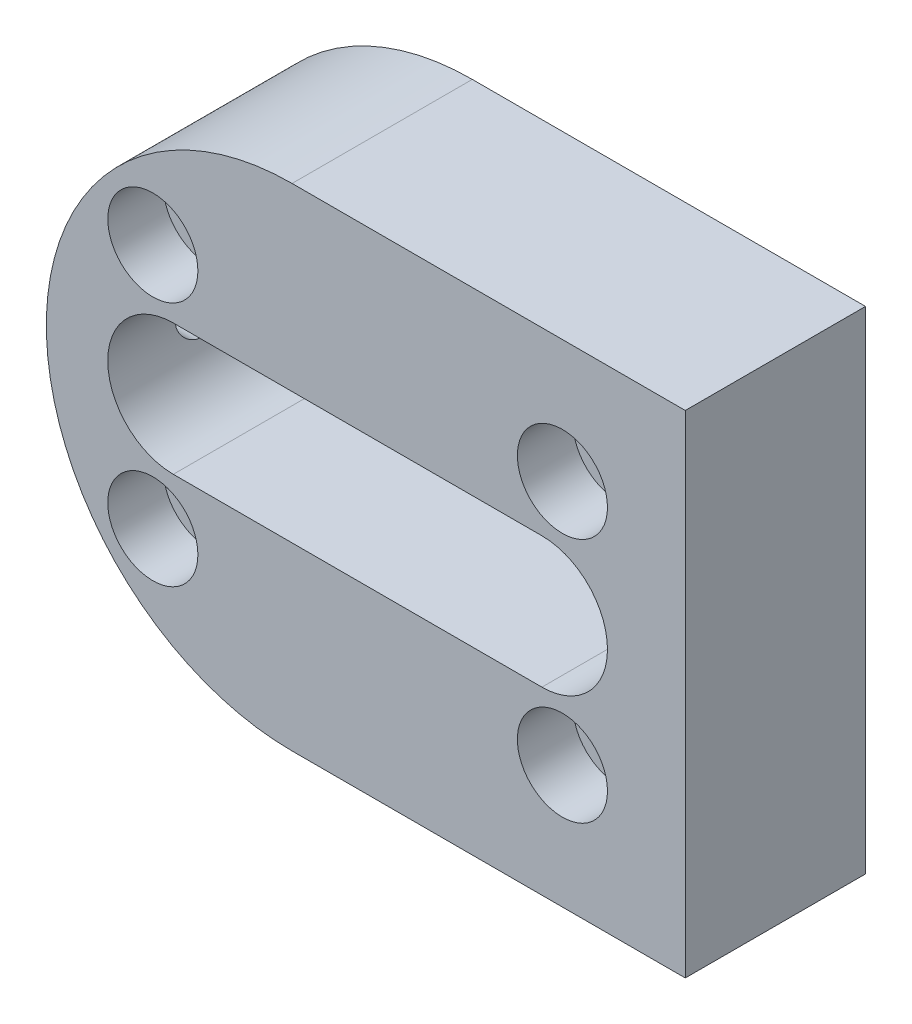
ISO-10303-21;
HEADER;
FILE_DESCRIPTION(('STEP AP214'),'2;1');
FILE_NAME('part.step','',(''),(''),'','','');
FILE_SCHEMA(('AUTOMOTIVE_DESIGN { 1 0 10303 214 1 1 1 1 }'));
ENDSEC;
DATA;
#1=APPLICATION_CONTEXT('core data for automotive mechanical design processes');
#2=APPLICATION_PROTOCOL_DEFINITION('international standard','automotive_design',2000,#1);
#3=PRODUCT_CONTEXT('',#1,'mechanical');
#4=PRODUCT('Part','Part','',(#3));
#5=PRODUCT_RELATED_PRODUCT_CATEGORY('part','',(#4));
#6=PRODUCT_DEFINITION_FORMATION('','',#4);
#7=PRODUCT_DEFINITION_CONTEXT('part definition',#1,'design');
#8=PRODUCT_DEFINITION('design','',#6,#7);
#9=PRODUCT_DEFINITION_SHAPE('','',#8);
#10=(LENGTH_UNIT() NAMED_UNIT(*) SI_UNIT(.MILLI.,.METRE.));
#11=(NAMED_UNIT(*) PLANE_ANGLE_UNIT() SI_UNIT($,.RADIAN.));
#12=(NAMED_UNIT(*) SI_UNIT($,.STERADIAN.) SOLID_ANGLE_UNIT());
#13=UNCERTAINTY_MEASURE_WITH_UNIT(LENGTH_MEASURE(1.E-05),#10,'distance_accuracy_value','');
#14=(GEOMETRIC_REPRESENTATION_CONTEXT(3) GLOBAL_UNCERTAINTY_ASSIGNED_CONTEXT((#13)) GLOBAL_UNIT_ASSIGNED_CONTEXT((#10,
#11,#12)) REPRESENTATION_CONTEXT('',''));
#15=CARTESIAN_POINT('',(0.,0.,0.));
#16=DIRECTION('',(0.,0.,1.));
#17=DIRECTION('',(1.,0.,0.));
#18=AXIS2_PLACEMENT_3D('',#15,#16,#17);
#19=CARTESIAN_POINT('',(-8.,0.,22.));
#20=DIRECTION('',(0.,0.,1.));
#21=DIRECTION('',(1.,0.,0.));
#22=AXIS2_PLACEMENT_3D('',#19,#20,#21);
#23=PLANE('',#22);
#24=CARTESIAN_POINT('',(-25.,15.,22.));
#25=DIRECTION('',(0.,0.,1.));
#26=DIRECTION('',(1.,0.,0.));
#27=AXIS2_PLACEMENT_3D('',#24,#25,#26);
#28=CIRCLE('',#27,5.5);
#29=CARTESIAN_POINT('',(-19.5,15.,22.));
#30=VERTEX_POINT('',#29);
#31=EDGE_CURVE('E222',#30,#30,#28,.T.);
#32=ORIENTED_EDGE('',*,*,#31,.F.);
#33=EDGE_LOOP('',(#32));
#34=FACE_BOUND('',#33,.T.);
#35=CARTESIAN_POINT('',(-25.,-15.,22.));
#36=DIRECTION('',(0.,0.,1.));
#37=DIRECTION('',(1.,0.,0.));
#38=AXIS2_PLACEMENT_3D('',#35,#36,#37);
#39=CIRCLE('',#38,5.5);
#40=CARTESIAN_POINT('',(-19.5,-15.,22.));
#41=VERTEX_POINT('',#40);
#42=EDGE_CURVE('E468',#41,#41,#39,.T.);
#43=ORIENTED_EDGE('',*,*,#42,.F.);
#44=EDGE_LOOP('',(#43));
#45=FACE_BOUND('',#44,.T.);
#46=CARTESIAN_POINT('',(25.,15.,22.));
#47=DIRECTION('',(0.,0.,1.));
#48=DIRECTION('',(1.,0.,0.));
#49=AXIS2_PLACEMENT_3D('',#46,#47,#48);
#50=CIRCLE('',#49,5.5);
#51=CARTESIAN_POINT('',(30.5,15.,22.));
#52=VERTEX_POINT('',#51);
#53=EDGE_CURVE('E456',#52,#52,#50,.T.);
#54=ORIENTED_EDGE('',*,*,#53,.F.);
#55=EDGE_LOOP('',(#54));
#56=FACE_BOUND('',#55,.T.);
#57=CARTESIAN_POINT('',(25.,-15.,22.));
#58=DIRECTION('',(0.,0.,1.));
#59=DIRECTION('',(1.,0.,0.));
#60=AXIS2_PLACEMENT_3D('',#57,#58,#59);
#61=CIRCLE('',#60,5.5);
#62=CARTESIAN_POINT('',(30.5,-15.,22.));
#63=VERTEX_POINT('',#62);
#64=EDGE_CURVE('E442',#63,#63,#61,.T.);
#65=ORIENTED_EDGE('',*,*,#64,.F.);
#66=EDGE_LOOP('',(#65));
#67=FACE_BOUND('',#66,.T.);
#68=DIRECTION('',(0.,1.,0.));
#69=VECTOR('',#68,1.);
#70=CARTESIAN_POINT('',(40.,30.,22.));
#71=LINE('',#70,#69);
#72=CARTESIAN_POINT('',(40.,-30.,22.));
#73=VERTEX_POINT('',#72);
#74=CARTESIAN_POINT('',(40.,30.,22.));
#75=VERTEX_POINT('',#74);
#76=EDGE_CURVE('E146',#73,#75,#71,.T.);
#77=ORIENTED_EDGE('',*,*,#76,.T.);
#78=DIRECTION('',(-1.,0.,0.));
#79=VECTOR('',#78,1.);
#80=CARTESIAN_POINT('',(-8.,30.,22.));
#81=LINE('',#80,#79);
#82=CARTESIAN_POINT('',(-8.,30.,22.));
#83=VERTEX_POINT('',#82);
#84=EDGE_CURVE('E149',#75,#83,#81,.T.);
#85=ORIENTED_EDGE('',*,*,#84,.T.);
#86=CARTESIAN_POINT('',(-8.,0.,22.));
#87=DIRECTION('',(0.,0.,1.));
#88=DIRECTION('',(1.,0.,0.));
#89=AXIS2_PLACEMENT_3D('',#86,#87,#88);
#90=CIRCLE('',#89,30.);
#91=CARTESIAN_POINT('',(-8.,-30.,22.));
#92=VERTEX_POINT('',#91);
#93=EDGE_CURVE('E152',#83,#92,#90,.T.);
#94=ORIENTED_EDGE('',*,*,#93,.T.);
#95=DIRECTION('',(1.,0.,0.));
#96=VECTOR('',#95,1.);
#97=CARTESIAN_POINT('',(-8.,-30.,22.));
#98=LINE('',#97,#96);
#99=EDGE_CURVE('E154',#92,#73,#98,.T.);
#100=ORIENTED_EDGE('',*,*,#99,.T.);
#101=EDGE_LOOP('',(#77,#85,#94,#100));
#102=FACE_BOUND('',#101,.T.);
#103=DIRECTION('',(1.,0.,0.));
#104=VECTOR('',#103,1.);
#105=CARTESIAN_POINT('',(-22.5,-8.00000000000001,22.));
#106=LINE('',#105,#104);
#107=CARTESIAN_POINT('',(-22.5,-8.00000000000001,22.));
#108=VERTEX_POINT('',#107);
#109=CARTESIAN_POINT('',(22.5,-7.99999999999999,22.));
#110=VERTEX_POINT('',#109);
#111=EDGE_CURVE('E116',#108,#110,#106,.T.);
#112=ORIENTED_EDGE('',*,*,#111,.F.);
#113=CARTESIAN_POINT('',(-22.5,0.,22.));
#114=DIRECTION('',(0.,0.,1.));
#115=DIRECTION('',(1.,0.,0.));
#116=AXIS2_PLACEMENT_3D('',#113,#114,#115);
#117=CIRCLE('',#116,8.);
#118=CARTESIAN_POINT('',(-22.5,7.99999999999999,22.));
#119=VERTEX_POINT('',#118);
#120=EDGE_CURVE('E108',#119,#108,#117,.T.);
#121=ORIENTED_EDGE('',*,*,#120,.F.);
#122=DIRECTION('',(-1.,0.,0.));
#123=VECTOR('',#122,1.);
#124=CARTESIAN_POINT('',(-22.5,7.99999999999999,22.));
#125=LINE('',#124,#123);
#126=CARTESIAN_POINT('',(22.5,8.00000000000001,22.));
#127=VERTEX_POINT('',#126);
#128=EDGE_CURVE('E130',#127,#119,#125,.T.);
#129=ORIENTED_EDGE('',*,*,#128,.F.);
#130=CARTESIAN_POINT('',(22.5,0.,22.));
#131=DIRECTION('',(0.,0.,1.));
#132=DIRECTION('',(1.,0.,0.));
#133=AXIS2_PLACEMENT_3D('',#130,#131,#132);
#134=CIRCLE('',#133,8.);
#135=EDGE_CURVE('E128',#110,#127,#134,.T.);
#136=ORIENTED_EDGE('',*,*,#135,.F.);
#137=EDGE_LOOP('',(#112,#121,#129,#136));
#138=FACE_BOUND('',#137,.T.);
#139=ADVANCED_FACE('F43',(#34,#45,#56,#67,#102,#138),#23,.T.);
#140=CARTESIAN_POINT('',(-8.,0.,0.));
#141=DIRECTION('',(0.,0.,1.));
#142=DIRECTION('',(1.,0.,0.));
#143=AXIS2_PLACEMENT_3D('',#140,#141,#142);
#144=PLANE('',#143);
#145=CARTESIAN_POINT('',(-25.,15.,0.));
#146=DIRECTION('',(0.,0.,1.));
#147=DIRECTION('',(1.,0.,0.));
#148=AXIS2_PLACEMENT_3D('',#145,#146,#147);
#149=CIRCLE('',#148,3.29999999999999);
#150=CARTESIAN_POINT('',(-21.7,15.,0.));
#151=VERTEX_POINT('',#150);
#152=EDGE_CURVE('E471',#151,#151,#149,.T.);
#153=ORIENTED_EDGE('',*,*,#152,.T.);
#154=EDGE_LOOP('',(#153));
#155=FACE_BOUND('',#154,.T.);
#156=CARTESIAN_POINT('',(-25.,-15.,0.));
#157=DIRECTION('',(0.,0.,1.));
#158=DIRECTION('',(1.,0.,0.));
#159=AXIS2_PLACEMENT_3D('',#156,#157,#158);
#160=CIRCLE('',#159,3.29999999999999);
#161=CARTESIAN_POINT('',(-21.7,-15.,0.));
#162=VERTEX_POINT('',#161);
#163=EDGE_CURVE('E459',#162,#162,#160,.T.);
#164=ORIENTED_EDGE('',*,*,#163,.T.);
#165=EDGE_LOOP('',(#164));
#166=FACE_BOUND('',#165,.T.);
#167=CARTESIAN_POINT('',(25.,15.,0.));
#168=DIRECTION('',(0.,0.,1.));
#169=DIRECTION('',(1.,0.,0.));
#170=AXIS2_PLACEMENT_3D('',#167,#168,#169);
#171=CIRCLE('',#170,3.29999999999999);
#172=CARTESIAN_POINT('',(28.3,15.,0.));
#173=VERTEX_POINT('',#172);
#174=EDGE_CURVE('E447',#173,#173,#171,.T.);
#175=ORIENTED_EDGE('',*,*,#174,.T.);
#176=EDGE_LOOP('',(#175));
#177=FACE_BOUND('',#176,.T.);
#178=CARTESIAN_POINT('',(25.,-15.,0.));
#179=DIRECTION('',(0.,0.,1.));
#180=DIRECTION('',(1.,0.,0.));
#181=AXIS2_PLACEMENT_3D('',#178,#179,#180);
#182=CIRCLE('',#181,3.29999999999999);
#183=CARTESIAN_POINT('',(28.3,-15.,0.));
#184=VERTEX_POINT('',#183);
#185=EDGE_CURVE('E136',#184,#184,#182,.T.);
#186=ORIENTED_EDGE('',*,*,#185,.T.);
#187=EDGE_LOOP('',(#186));
#188=FACE_BOUND('',#187,.T.);
#189=DIRECTION('',(0.,1.,0.));
#190=VECTOR('',#189,1.);
#191=CARTESIAN_POINT('',(40.,30.,0.));
#192=LINE('',#191,#190);
#193=CARTESIAN_POINT('',(40.,-30.,0.));
#194=VERTEX_POINT('',#193);
#195=CARTESIAN_POINT('',(40.,30.,0.));
#196=VERTEX_POINT('',#195);
#197=EDGE_CURVE('E124',#194,#196,#192,.T.);
#198=ORIENTED_EDGE('',*,*,#197,.F.);
#199=DIRECTION('',(1.,0.,0.));
#200=VECTOR('',#199,1.);
#201=CARTESIAN_POINT('',(-8.,-30.,0.));
#202=LINE('',#201,#200);
#203=CARTESIAN_POINT('',(-8.,-30.,0.));
#204=VERTEX_POINT('',#203);
#205=EDGE_CURVE('E150',#204,#194,#202,.T.);
#206=ORIENTED_EDGE('',*,*,#205,.F.);
#207=CARTESIAN_POINT('',(-8.,0.,0.));
#208=DIRECTION('',(0.,0.,1.));
#209=DIRECTION('',(1.,0.,0.));
#210=AXIS2_PLACEMENT_3D('',#207,#208,#209);
#211=CIRCLE('',#210,30.);
#212=CARTESIAN_POINT('',(-8.,30.,0.));
#213=VERTEX_POINT('',#212);
#214=EDGE_CURVE('E161',#213,#204,#211,.T.);
#215=ORIENTED_EDGE('',*,*,#214,.F.);
#216=DIRECTION('',(-1.,0.,0.));
#217=VECTOR('',#216,1.);
#218=CARTESIAN_POINT('',(-8.,30.,0.));
#219=LINE('',#218,#217);
#220=EDGE_CURVE('E159',#196,#213,#219,.T.);
#221=ORIENTED_EDGE('',*,*,#220,.F.);
#222=EDGE_LOOP('',(#198,#206,#215,#221));
#223=FACE_BOUND('',#222,.T.);
#224=CARTESIAN_POINT('',(-22.5,0.,0.));
#225=DIRECTION('',(0.,0.,1.));
#226=DIRECTION('',(1.,0.,0.));
#227=AXIS2_PLACEMENT_3D('',#224,#225,#226);
#228=CIRCLE('',#227,8.);
#229=CARTESIAN_POINT('',(-22.5,7.99999999999999,0.));
#230=VERTEX_POINT('',#229);
#231=CARTESIAN_POINT('',(-22.5,-8.00000000000001,0.));
#232=VERTEX_POINT('',#231);
#233=EDGE_CURVE('E66',#230,#232,#228,.T.);
#234=ORIENTED_EDGE('',*,*,#233,.T.);
#235=DIRECTION('',(1.,0.,0.));
#236=VECTOR('',#235,1.);
#237=CARTESIAN_POINT('',(-22.5,-8.00000000000001,0.));
#238=LINE('',#237,#236);
#239=CARTESIAN_POINT('',(22.5,-7.99999999999999,0.));
#240=VERTEX_POINT('',#239);
#241=EDGE_CURVE('E123',#232,#240,#238,.T.);
#242=ORIENTED_EDGE('',*,*,#241,.T.);
#243=CARTESIAN_POINT('',(22.5,0.,0.));
#244=DIRECTION('',(0.,0.,1.));
#245=DIRECTION('',(1.,0.,0.));
#246=AXIS2_PLACEMENT_3D('',#243,#244,#245);
#247=CIRCLE('',#246,8.);
#248=CARTESIAN_POINT('',(22.5,8.00000000000001,0.));
#249=VERTEX_POINT('',#248);
#250=EDGE_CURVE('E138',#240,#249,#247,.T.);
#251=ORIENTED_EDGE('',*,*,#250,.T.);
#252=DIRECTION('',(-1.,0.,0.));
#253=VECTOR('',#252,1.);
#254=CARTESIAN_POINT('',(-22.5,7.99999999999999,0.));
#255=LINE('',#254,#253);
#256=EDGE_CURVE('E117',#249,#230,#255,.T.);
#257=ORIENTED_EDGE('',*,*,#256,.T.);
#258=EDGE_LOOP('',(#234,#242,#251,#257));
#259=FACE_BOUND('',#258,.T.);
#260=ADVANCED_FACE('F179',(#155,#166,#177,#188,#223,#259),#144,.F.);
#261=CARTESIAN_POINT('',(40.,30.,22.));
#262=DIRECTION('',(-1.,0.,0.));
#263=DIRECTION('',(0.,-1.,0.));
#264=AXIS2_PLACEMENT_3D('',#261,#262,#263);
#265=PLANE('',#264);
#266=ORIENTED_EDGE('',*,*,#197,.T.);
#267=DIRECTION('',(0.,0.,-1.));
#268=VECTOR('',#267,1.);
#269=CARTESIAN_POINT('',(40.,30.,22.));
#270=LINE('',#269,#268);
#271=EDGE_CURVE('E12',#75,#196,#270,.T.);
#272=ORIENTED_EDGE('',*,*,#271,.F.);
#273=ORIENTED_EDGE('',*,*,#76,.F.);
#274=DIRECTION('',(0.,0.,-1.));
#275=VECTOR('',#274,1.);
#276=CARTESIAN_POINT('',(40.,-30.,22.));
#277=LINE('',#276,#275);
#278=EDGE_CURVE('E156',#73,#194,#277,.T.);
#279=ORIENTED_EDGE('',*,*,#278,.T.);
#280=EDGE_LOOP('',(#266,#272,#273,#279));
#281=FACE_BOUND('',#280,.T.);
#282=ADVANCED_FACE('F45',(#281),#265,.F.);
#283=CARTESIAN_POINT('',(-8.,30.,22.));
#284=DIRECTION('',(0.,-1.,0.));
#285=DIRECTION('',(0.,0.,-1.));
#286=AXIS2_PLACEMENT_3D('',#283,#284,#285);
#287=PLANE('',#286);
#288=ORIENTED_EDGE('',*,*,#220,.T.);
#289=DIRECTION('',(0.,0.,-1.));
#290=VECTOR('',#289,1.);
#291=CARTESIAN_POINT('',(-8.,30.,22.));
#292=LINE('',#291,#290);
#293=EDGE_CURVE('E51',#83,#213,#292,.T.);
#294=ORIENTED_EDGE('',*,*,#293,.F.);
#295=ORIENTED_EDGE('',*,*,#84,.F.);
#296=ORIENTED_EDGE('',*,*,#271,.T.);
#297=EDGE_LOOP('',(#288,#294,#295,#296));
#298=FACE_BOUND('',#297,.T.);
#299=ADVANCED_FACE('F189',(#298),#287,.F.);
#300=CARTESIAN_POINT('',(-8.,0.,22.));
#301=DIRECTION('',(0.,0.,-1.));
#302=DIRECTION('',(-1.,0.,0.));
#303=AXIS2_PLACEMENT_3D('',#300,#301,#302);
#304=CYLINDRICAL_SURFACE('',#303,30.);
#305=CARTESIAN_POINT('',(-38.,0.,13.75));
#306=CARTESIAN_POINT('',(-37.9999983608672,-0.154121681629664,13.7499932948716));
#307=CARTESIAN_POINT('',(-37.9987996837774,-0.308346841218053,13.7369999483168));
#308=CARTESIAN_POINT('',(-37.9941331788612,-0.612525944484366,13.6853605522202));
#309=CARTESIAN_POINT('',(-37.9906628141041,-0.762474917080442,13.6466858220299));
#310=CARTESIAN_POINT('',(-37.981844898602,-1.05365246063933,13.5448150560427));
#311=CARTESIAN_POINT('',(-37.9764984444291,-1.1948860691414,13.4816333422805));
#312=CARTESIAN_POINT('',(-37.9645270903387,-1.46471123683495,13.3325687898649));
#313=CARTESIAN_POINT('',(-37.9579024547567,-1.59330540165168,13.2466906436107));
#314=CARTESIAN_POINT('',(-37.9440948948764,-1.83462601095741,13.0543890344445));
#315=CARTESIAN_POINT('',(-37.9369105069061,-1.94730852975758,12.9479105489597));
#316=CARTESIAN_POINT('',(-37.9228053623754,-2.15322998090237,12.7175476656018));
#317=CARTESIAN_POINT('',(-37.915884617695,-2.24646803790792,12.5936624845446));
#318=CARTESIAN_POINT('',(-37.9030750365525,-2.4110061699978,12.3317322023381));
#319=CARTESIAN_POINT('',(-37.8971880519291,-2.48226704519611,12.1936623784652));
#320=CARTESIAN_POINT('',(-37.8871300421701,-2.60057763590382,11.9074539790614));
#321=CARTESIAN_POINT('',(-37.882958980977,-2.64762786016949,11.7593156151823));
#322=CARTESIAN_POINT('',(-37.8768178841711,-2.71605268273769,11.4576195621842));
#323=CARTESIAN_POINT('',(-37.8748416559271,-2.73749953280295,11.3040783879462));
#324=CARTESIAN_POINT('',(-37.8732945957623,-2.75433208282886,10.9955639081174));
#325=CARTESIAN_POINT('',(-37.873723710079,-2.74971836527613,10.8405906346131));
#326=CARTESIAN_POINT('',(-37.8769332078827,-2.71462037998803,10.5341076049907));
#327=CARTESIAN_POINT('',(-37.8797064388463,-2.68421480905826,10.3825887512316));
#328=CARTESIAN_POINT('',(-37.8872805025503,-2.59851857261535,10.0868139737903));
#329=CARTESIAN_POINT('',(-37.8920813587285,-2.54322761944603,9.94255813408434));
#330=CARTESIAN_POINT('',(-37.9031779732845,-2.40924260854888,9.66515453033673));
#331=CARTESIAN_POINT('',(-37.9094759721256,-2.33051343069361,9.53202382245986));
#332=CARTESIAN_POINT('',(-37.9228552674344,-2.15191208005073,9.28083615226833));
#333=CARTESIAN_POINT('',(-37.9299365831388,-2.05203938796455,9.16277956029801));
#334=CARTESIAN_POINT('',(-37.9441164771174,-1.83354552161785,8.94463386649175));
#335=CARTESIAN_POINT('',(-37.951215022322,-1.71485634631172,8.84461285943281));
#336=CARTESIAN_POINT('',(-37.9646046984805,-1.46233536889141,8.66590467542207));
#337=CARTESIAN_POINT('',(-37.970895828734,-1.32850355363763,8.58721751698231));
#338=CARTESIAN_POINT('',(-37.9819634347898,-1.04945063478142,8.45341418876828));
#339=CARTESIAN_POINT('',(-37.9867397033011,-0.904227975864935,8.39830124448734));
#340=CARTESIAN_POINT('',(-37.9942371924094,-0.606536942995662,8.31325953774626));
#341=CARTESIAN_POINT('',(-37.9969584646249,-0.45406875114279,8.28333014270843));
#342=CARTESIAN_POINT('',(-38.0000327224964,-0.146804643963102,8.24959097792519));
#343=CARTESIAN_POINT('',(-38.0003942322921,0.0079808665702081,8.24568719510033));
#344=CARTESIAN_POINT('',(-37.9987310428139,0.316004043905335,8.26386348104704));
#345=CARTESIAN_POINT('',(-37.9967063705506,0.469241728208175,8.28594325569425));
#346=CARTESIAN_POINT('',(-37.9905038967387,0.769549766387452,8.3553819360453));
#347=CARTESIAN_POINT('',(-37.9863298252228,0.916630328665863,8.40269705381038));
#348=CARTESIAN_POINT('',(-37.9762971493149,1.20076578880905,8.52121846287511));
#349=CARTESIAN_POINT('',(-37.9704385129247,1.33782049617102,8.59242520799969));
#350=CARTESIAN_POINT('',(-37.9576715267008,1.59844028178346,8.75694334733904));
#351=CARTESIAN_POINT('',(-37.9507602507158,1.72196605327635,8.85031677830798));
#352=CARTESIAN_POINT('',(-37.9366736108735,1.95162421902399,9.0564284640084));
#353=CARTESIAN_POINT('',(-37.9294982414617,2.05775624718783,9.16916712622299));
#354=CARTESIAN_POINT('',(-37.9156666876417,2.24993859568955,9.41121807801568));
#355=CARTESIAN_POINT('',(-37.909012133993,2.33592739787935,9.5405793176564));
#356=CARTESIAN_POINT('',(-37.8969996386651,2.48496005937158,9.81196074411221));
#357=CARTESIAN_POINT('',(-37.8916416817318,2.54800418861708,9.95398078197263));
#358=CARTESIAN_POINT('',(-37.8828387215092,2.64925398019107,10.2464338262599));
#359=CARTESIAN_POINT('',(-37.8793908579167,2.6874967964211,10.3968538800439));
#360=CARTESIAN_POINT('',(-37.8747892506879,2.73817916067784,10.7020132725809));
#361=CARTESIAN_POINT('',(-37.8736354526622,2.75061932045307,10.8567525088434));
#362=CARTESIAN_POINT('',(-37.8737535859389,2.74933550484595,11.1655464014409));
#363=CARTESIAN_POINT('',(-37.8750165569957,2.73570817554465,11.3196014721811));
#364=CARTESIAN_POINT('',(-37.8798068547261,2.68287827015408,11.6232245618737));
#365=CARTESIAN_POINT('',(-37.8833341844517,2.64367565959181,11.7727925747776));
#366=CARTESIAN_POINT('',(-37.8922533418161,2.54083356433672,12.0631987397539));
#367=CARTESIAN_POINT('',(-37.8976449956125,2.47719635803314,12.2040377043394));
#368=CARTESIAN_POINT('',(-37.9096856346447,2.32730183855704,12.4730497202608));
#369=CARTESIAN_POINT('',(-37.916334606231,2.24104477094551,12.6012229090753));
#370=CARTESIAN_POINT('',(-37.930170152632,2.04799569033739,12.8417601327363));
#371=CARTESIAN_POINT('',(-37.937358552867,1.94113183598966,12.9540664051525));
#372=CARTESIAN_POINT('',(-37.9514462918571,1.71003979201758,13.1591982037161));
#373=CARTESIAN_POINT('',(-37.9583455605973,1.58580742772878,13.2520190329192));
#374=CARTESIAN_POINT('',(-37.9710927561737,1.32321699019954,13.4156974418461));
#375=CARTESIAN_POINT('',(-37.9769383677804,1.18482883246218,13.4865068967323));
#376=CARTESIAN_POINT('',(-37.9868935364189,0.898165061862298,13.6037913780196));
#377=CARTESIAN_POINT('',(-37.9910050697991,0.74990092923372,13.6502941216048));
#378=CARTESIAN_POINT('',(-37.9959839945185,0.500648943055234,13.7059197994269));
#379=CARTESIAN_POINT('',(-37.9974830612875,0.401259616743739,13.7224276117616));
#380=CARTESIAN_POINT('',(-37.9994915976173,0.201261568886977,13.7444698832411));
#381=CARTESIAN_POINT('',(-38.0000010704749,0.100652851405351,13.7500043789445));
#382=CARTESIAN_POINT('',(-38.,0.,13.75));
#383=B_SPLINE_CURVE_WITH_KNOTS('',3,(#305,#306,#307,#308,#309,#310,#311,#312,#313,#314,#315,
#316,#317,#318,#319,#320,#321,#322,#323,#324,#325,#326,#327,#328,#329,#330,#331,#332,#333,#334,
#335,#336,#337,#338,#339,#340,#341,#342,#343,#344,#345,#346,#347,#348,#349,#350,#351,#352,#353,
#354,#355,#356,#357,#358,#359,#360,#361,#362,#363,#364,#365,#366,#367,#368,#369,#370,#371,#372,
#373,#374,#375,#376,#377,#378,#379,#380,#381,#382),.UNSPECIFIED.,.T.,.F.,(4,2,2,2,2,2,2,2,2,2,2,
2,2,2,2,2,2,2,2,2,2,2,2,2,2,2,2,2,2,2,2,2,2,2,2,2,2,2,4),(0.,0.461997526601378,
0.924511875965964,1.386756335306,1.84890530205925,2.31230612777251,2.77572781008438,
3.23997136270055,3.70420515942604,4.16712578542848,4.63003606461077,5.09153895900569,
5.55304718816158,6.01525045772465,6.47746508062031,6.94138986986912,7.40531506167877,
7.86930370880956,8.33328070080695,8.79558074272598,9.25787555162793,9.71937079180698,
10.1808747986512,10.6436859439561,11.1065068289242,11.5707232759873,12.0349342613876,
12.4984482137181,12.9619511765901,13.4237390169575,13.8855274797714,14.3472728938493,
14.8090132954311,15.2723935556751,15.7358853852791,16.2003835620784,16.6643509050609,
16.9660704478755,17.2677889854814),.UNSPECIFIED.);
#384=CARTESIAN_POINT('',(-38.,0.,13.75));
#385=VERTEX_POINT('',#384);
#386=EDGE_CURVE('E214',#385,#385,#383,.T.);
#387=ORIENTED_EDGE('',*,*,#386,.T.);
#388=EDGE_LOOP('',(#387));
#389=FACE_BOUND('',#388,.T.);
#390=ORIENTED_EDGE('',*,*,#214,.T.);
#391=DIRECTION('',(0.,0.,-1.));
#392=VECTOR('',#391,1.);
#393=CARTESIAN_POINT('',(-8.,-30.,22.));
#394=LINE('',#393,#392);
#395=EDGE_CURVE('E166',#92,#204,#394,.T.);
#396=ORIENTED_EDGE('',*,*,#395,.F.);
#397=ORIENTED_EDGE('',*,*,#93,.F.);
#398=ORIENTED_EDGE('',*,*,#293,.T.);
#399=EDGE_LOOP('',(#390,#396,#397,#398));
#400=FACE_BOUND('',#399,.T.);
#401=ADVANCED_FACE('F173',(#389,#400),#304,.T.);
#402=CARTESIAN_POINT('',(-8.,-30.,22.));
#403=DIRECTION('',(0.,1.,0.));
#404=DIRECTION('',(-1.,0.,0.));
#405=AXIS2_PLACEMENT_3D('',#402,#403,#404);
#406=PLANE('',#405);
#407=ORIENTED_EDGE('',*,*,#205,.T.);
#408=ORIENTED_EDGE('',*,*,#278,.F.);
#409=ORIENTED_EDGE('',*,*,#99,.F.);
#410=ORIENTED_EDGE('',*,*,#395,.T.);
#411=EDGE_LOOP('',(#407,#408,#409,#410));
#412=FACE_BOUND('',#411,.T.);
#413=ADVANCED_FACE('F183',(#412),#406,.F.);
#414=CARTESIAN_POINT('',(-22.5,0.,22.));
#415=DIRECTION('',(0.,0.,-1.));
#416=DIRECTION('',(-1.,0.,0.));
#417=AXIS2_PLACEMENT_3D('',#414,#415,#416);
#418=CYLINDRICAL_SURFACE('',#417,8.);
#419=CARTESIAN_POINT('',(-30.5,0.,13.75));
#420=CARTESIAN_POINT('',(-30.5000011456176,-0.149780081985368,13.7500016816094));
#421=CARTESIAN_POINT('',(-30.4957553298678,-0.299548298826679,13.737723750222));
#422=CARTESIAN_POINT('',(-30.4792375112327,-0.594657342686866,13.6890981808044));
#423=CARTESIAN_POINT('',(-30.4669651730275,-0.739997984471767,13.6527495371838));
#424=CARTESIAN_POINT('',(-30.4357239733388,-1.02195487978178,13.5573869425151));
#425=CARTESIAN_POINT('',(-30.4167667335248,-1.15858579145297,13.4984123110826));
#426=CARTESIAN_POINT('',(-30.3740792597928,-1.42001515243357,13.359654915469));
#427=CARTESIAN_POINT('',(-30.3503479939089,-1.54481103485589,13.2798676512675));
#428=CARTESIAN_POINT('',(-30.2996285569884,-1.78358955367625,13.0986906891578));
#429=CARTESIAN_POINT('',(-30.2725588327754,-1.89708036591325,12.9966757849521));
#430=CARTESIAN_POINT('',(-30.2186502652035,-2.10572373796169,12.7752679195138));
#431=CARTESIAN_POINT('',(-30.1918114785715,-2.20087190843667,12.6558708107419));
#432=CARTESIAN_POINT('',(-30.1404941832714,-2.37301177080315,12.3985701631533));
#433=CARTESIAN_POINT('',(-30.1161143378533,-2.44935095281462,12.2602084873841));
#434=CARTESIAN_POINT('',(-30.0737222571145,-2.57746356840447,11.971637336747));
#435=CARTESIAN_POINT('',(-30.0557079374949,-2.62924504494982,11.8214317597331));
#436=CARTESIAN_POINT('',(-30.028948392681,-2.70490383804144,11.5190486383949));
#437=CARTESIAN_POINT('',(-30.0198965885595,-2.729707187894,11.3671307572068));
#438=CARTESIAN_POINT('',(-30.0111822373909,-2.75360105782879,11.0610405795477));
#439=CARTESIAN_POINT('',(-30.011516567294,-2.75270013049735,10.9068690499982));
#440=CARTESIAN_POINT('',(-30.0212690701405,-2.72592734586188,10.6086767949502));
#441=CARTESIAN_POINT('',(-30.0302413109147,-2.70128128534537,10.4645288573901));
#442=CARTESIAN_POINT('',(-30.0555262630898,-2.629723943826,10.1825545714861));
#443=CARTESIAN_POINT('',(-30.0718399059163,-2.58280983756812,10.0447290277289));
#444=CARTESIAN_POINT('',(-30.1102751035879,-2.46727770067189,9.77659659677683));
#445=CARTESIAN_POINT('',(-30.1324898143721,-2.39830756807453,9.64645535594637));
#446=CARTESIAN_POINT('',(-30.1801869970592,-2.24086572694034,9.39921373045136));
#447=CARTESIAN_POINT('',(-30.2056704590045,-2.15238810409514,9.28211731697755));
#448=CARTESIAN_POINT('',(-30.2587699054083,-1.95262263960914,9.05742470989958));
#449=CARTESIAN_POINT('',(-30.2864255735354,-1.84033811734006,8.95072210508404));
#450=CARTESIAN_POINT('',(-30.3395157411675,-1.59913248518229,8.75742025810626));
#451=CARTESIAN_POINT('',(-30.3649499995271,-1.47020957286492,8.6708231968167));
#452=CARTESIAN_POINT('',(-30.4111033640027,-1.19740022071252,8.51940958309566));
#453=CARTESIAN_POINT('',(-30.4317668117842,-1.05336314333696,8.45484630067457));
#454=CARTESIAN_POINT('',(-30.4656445477559,-0.75559017379895,8.3511487019459));
#455=CARTESIAN_POINT('',(-30.478861594966,-0.60185789738188,8.31200496643611));
#456=CARTESIAN_POINT('',(-30.4958935195341,-0.29661277470525,8.26187280437486));
#457=CARTESIAN_POINT('',(-30.5001109627,-0.145320277408035,8.24967796084124));
#458=CARTESIAN_POINT('',(-30.4998846360404,0.157188098342904,8.25033484297444));
#459=CARTESIAN_POINT('',(-30.4954424341495,0.308403985709137,8.26318203447462));
#460=CARTESIAN_POINT('',(-30.4786619332223,0.601546279345339,8.31261186435769));
#461=CARTESIAN_POINT('',(-30.4665740933188,0.743615321719037,8.3484421212445));
#462=CARTESIAN_POINT('',(-30.4359686090099,1.01965879405969,8.44186840673479));
#463=CARTESIAN_POINT('',(-30.4174501362784,1.15363217861842,8.49946723942023));
#464=CARTESIAN_POINT('',(-30.3752249459349,1.41374527739032,8.63652322634559));
#465=CARTESIAN_POINT('',(-30.3513908911891,1.53957309493145,8.71653194388182));
#466=CARTESIAN_POINT('',(-30.3012225379384,1.77640230529008,8.89549504411103));
#467=CARTESIAN_POINT('',(-30.2748874353095,1.88739890185312,8.99445553054527));
#468=CARTESIAN_POINT('',(-30.2210611624047,2.09702132308728,9.21417974254248));
#469=CARTESIAN_POINT('',(-30.193575830358,2.19478672298595,9.3357678027379));
#470=CARTESIAN_POINT('',(-30.141842776458,2.36864796542164,9.59420551261036));
#471=CARTESIAN_POINT('',(-30.1175951330109,2.44474328323046,9.73105553173505));
#472=CARTESIAN_POINT('',(-30.0752952712842,2.57283393306179,10.0164083612441));
#473=CARTESIAN_POINT('',(-30.0572380402514,2.62484877652662,10.1649016230815));
#474=CARTESIAN_POINT('',(-30.029689188767,2.70287369680089,10.4693116905502));
#475=CARTESIAN_POINT('',(-30.020193380664,2.72889648778362,10.6252248275628));
#476=CARTESIAN_POINT('',(-30.01133867644,2.75316931161014,10.9308975385842));
#477=CARTESIAN_POINT('',(-30.0114551889646,2.75285658220971,11.0805289820525));
#478=CARTESIAN_POINT('',(-30.0205033722152,2.72803949557786,11.3774865034692));
#479=CARTESIAN_POINT('',(-30.029434452474,2.7035367587783,11.5248127351668));
#480=CARTESIAN_POINT('',(-30.054703093893,2.63207907310228,11.8098082864726));
#481=CARTESIAN_POINT('',(-30.0708772799694,2.58561819535977,11.9476171312751));
#482=CARTESIAN_POINT('',(-30.1087404316213,2.47197076917428,12.2135848193288));
#483=CARTESIAN_POINT('',(-30.1304306680189,2.40477944395917,12.3417414300068));
#484=CARTESIAN_POINT('',(-30.1781220871156,2.2479857838714,12.5911444163292));
#485=CARTESIAN_POINT('',(-30.2042753988481,2.15749666642801,12.7118039823194));
#486=CARTESIAN_POINT('',(-30.2573383954068,1.95814409406896,12.9366890129796));
#487=CARTESIAN_POINT('',(-30.2842482985196,1.84927529007616,13.0409096762736));
#488=CARTESIAN_POINT('',(-30.3371637385885,1.6107116324798,13.2344301128775));
#489=CARTESIAN_POINT('',(-30.3630824298939,1.48032902718474,13.3229089598698));
#490=CARTESIAN_POINT('',(-30.4098501735615,1.20567117795411,13.476612151955));
#491=CARTESIAN_POINT('',(-30.4307001388719,1.06139844236926,13.5418406857413));
#492=CARTESIAN_POINT('',(-30.4645410614796,0.766529522997578,13.6455183481703));
#493=CARTESIAN_POINT('',(-30.4777068623396,0.616164809419493,13.6845665320037));
#494=CARTESIAN_POINT('',(-30.4954343535885,0.310528084036301,13.7368023258135));
#495=CARTESIAN_POINT('',(-30.4999988124861,0.155257667593279,13.7499982568927));
#496=CARTESIAN_POINT('',(-30.5,0.,13.75));
#497=B_SPLINE_CURVE_WITH_KNOTS('',3,(#419,#420,#421,#422,#423,#424,#425,#426,#427,#428,#429,
#430,#431,#432,#433,#434,#435,#436,#437,#438,#439,#440,#441,#442,#443,#444,#445,#446,#447,#448,
#449,#450,#451,#452,#453,#454,#455,#456,#457,#458,#459,#460,#461,#462,#463,#464,#465,#466,#467,
#468,#469,#470,#471,#472,#473,#474,#475,#476,#477,#478,#479,#480,#481,#482,#483,#484,#485,#486,
#487,#488,#489,#490,#491,#492,#493,#494,#495,#496),.UNSPECIFIED.,.T.,.F.,(4,2,2,2,2,2,2,2,2,2,2,
2,2,2,2,2,2,2,2,2,2,2,2,2,2,2,2,2,2,2,2,2,2,2,2,2,2,2,4),(0.,0.448768572434441,
0.897555894035541,1.34556681660528,1.79367468662697,2.25654857017809,2.71953308087446,
3.19683587462653,3.67398223738616,4.13417625073199,4.59421714547093,5.0317149699001,
5.46926831664446,5.91418814919565,6.35924305911265,6.8291099491379,7.29902778240723,
7.77417829005288,8.24915263026375,8.70239221909291,9.15554975097606,9.59458114946661,
10.033669120324,10.484691628661,10.9358596415439,11.4088966382186,11.8819450882304,
12.3546095723172,12.827042736251,13.2737109259201,13.7203491963648,14.1573843224694,
14.5945202268286,15.051711965957,15.5090369926181,15.9857702454127,16.4624175681852,
16.9277477920028,17.3929282146718),.UNSPECIFIED.);
#498=CARTESIAN_POINT('',(-30.5,0.,13.75));
#499=VERTEX_POINT('',#498);
#500=EDGE_CURVE('E223',#499,#499,#497,.T.);
#501=ORIENTED_EDGE('',*,*,#500,.F.);
#502=EDGE_LOOP('',(#501));
#503=FACE_BOUND('',#502,.T.);
#504=ORIENTED_EDGE('',*,*,#233,.F.);
#505=DIRECTION('',(0.,0.,-1.));
#506=VECTOR('',#505,1.);
#507=CARTESIAN_POINT('',(-22.5,7.99999999999999,22.));
#508=LINE('',#507,#506);
#509=EDGE_CURVE('E112',#119,#230,#508,.T.);
#510=ORIENTED_EDGE('',*,*,#509,.F.);
#511=ORIENTED_EDGE('',*,*,#120,.T.);
#512=DIRECTION('',(0.,0.,-1.));
#513=VECTOR('',#512,1.);
#514=CARTESIAN_POINT('',(-22.5,-8.00000000000001,22.));
#515=LINE('',#514,#513);
#516=EDGE_CURVE('E111',#108,#232,#515,.T.);
#517=ORIENTED_EDGE('',*,*,#516,.T.);
#518=EDGE_LOOP('',(#504,#510,#511,#517));
#519=FACE_BOUND('',#518,.T.);
#520=ADVANCED_FACE('F110',(#503,#519),#418,.F.);
#521=CARTESIAN_POINT('',(-22.5,-8.00000000000001,22.));
#522=DIRECTION('',(0.,1.,0.));
#523=DIRECTION('',(-1.,0.,0.));
#524=AXIS2_PLACEMENT_3D('',#521,#522,#523);
#525=PLANE('',#524);
#526=ORIENTED_EDGE('',*,*,#241,.F.);
#527=ORIENTED_EDGE('',*,*,#516,.F.);
#528=ORIENTED_EDGE('',*,*,#111,.T.);
#529=DIRECTION('',(0.,0.,-1.));
#530=VECTOR('',#529,1.);
#531=CARTESIAN_POINT('',(22.5,-7.99999999999999,22.));
#532=LINE('',#531,#530);
#533=EDGE_CURVE('E125',#110,#240,#532,.T.);
#534=ORIENTED_EDGE('',*,*,#533,.T.);
#535=EDGE_LOOP('',(#526,#527,#528,#534));
#536=FACE_BOUND('',#535,.T.);
#537=ADVANCED_FACE('F120',(#536),#525,.T.);
#538=CARTESIAN_POINT('',(22.5,0.,22.));
#539=DIRECTION('',(0.,0.,-1.));
#540=DIRECTION('',(-1.,0.,0.));
#541=AXIS2_PLACEMENT_3D('',#538,#539,#540);
#542=CYLINDRICAL_SURFACE('',#541,8.);
#543=ORIENTED_EDGE('',*,*,#250,.F.);
#544=ORIENTED_EDGE('',*,*,#533,.F.);
#545=ORIENTED_EDGE('',*,*,#135,.T.);
#546=DIRECTION('',(0.,0.,-1.));
#547=VECTOR('',#546,1.);
#548=CARTESIAN_POINT('',(22.5,8.00000000000001,22.));
#549=LINE('',#548,#547);
#550=EDGE_CURVE('E58',#127,#249,#549,.T.);
#551=ORIENTED_EDGE('',*,*,#550,.T.);
#552=EDGE_LOOP('',(#543,#544,#545,#551));
#553=FACE_BOUND('',#552,.T.);
#554=ADVANCED_FACE('F287',(#553),#542,.F.);
#555=CARTESIAN_POINT('',(-22.5,7.99999999999999,22.));
#556=DIRECTION('',(0.,-1.,0.));
#557=DIRECTION('',(1.,0.,0.));
#558=AXIS2_PLACEMENT_3D('',#555,#556,#557);
#559=PLANE('',#558);
#560=ORIENTED_EDGE('',*,*,#256,.F.);
#561=ORIENTED_EDGE('',*,*,#550,.F.);
#562=ORIENTED_EDGE('',*,*,#128,.T.);
#563=ORIENTED_EDGE('',*,*,#509,.T.);
#564=EDGE_LOOP('',(#560,#561,#562,#563));
#565=FACE_BOUND('',#564,.T.);
#566=ADVANCED_FACE('F283',(#565),#559,.T.);
#567=CARTESIAN_POINT('',(25.,-15.,22.));
#568=DIRECTION('',(0.,0.,1.));
#569=DIRECTION('',(1.,0.,0.));
#570=AXIS2_PLACEMENT_3D('',#567,#568,#569);
#571=CYLINDRICAL_SURFACE('',#570,3.3);
#572=ORIENTED_EDGE('',*,*,#185,.F.);
#573=EDGE_LOOP('',(#572));
#574=FACE_BOUND('',#573,.T.);
#575=CARTESIAN_POINT('',(25.,-15.,15.2));
#576=DIRECTION('',(0.,0.,1.));
#577=DIRECTION('',(1.,0.,0.));
#578=AXIS2_PLACEMENT_3D('',#575,#576,#577);
#579=CIRCLE('',#578,3.3);
#580=CARTESIAN_POINT('',(28.3,-15.,15.2));
#581=VERTEX_POINT('',#580);
#582=EDGE_CURVE('E438',#581,#581,#579,.T.);
#583=ORIENTED_EDGE('',*,*,#582,.T.);
#584=EDGE_LOOP('',(#583));
#585=FACE_BOUND('',#584,.T.);
#586=ADVANCED_FACE('F279',(#574,#585),#571,.F.);
#587=CARTESIAN_POINT('',(28.3,-15.,15.2));
#588=DIRECTION('',(0.,0.,-1.));
#589=DIRECTION('',(-1.,0.,0.));
#590=AXIS2_PLACEMENT_3D('',#587,#588,#589);
#591=PLANE('',#590);
#592=ORIENTED_EDGE('',*,*,#582,.F.);
#593=EDGE_LOOP('',(#592));
#594=FACE_BOUND('',#593,.T.);
#595=CARTESIAN_POINT('',(25.,-15.,15.2));
#596=DIRECTION('',(0.,0.,1.));
#597=DIRECTION('',(1.,0.,0.));
#598=AXIS2_PLACEMENT_3D('',#595,#596,#597);
#599=CIRCLE('',#598,5.5);
#600=CARTESIAN_POINT('',(30.5,-15.,15.2));
#601=VERTEX_POINT('',#600);
#602=EDGE_CURVE('E439',#601,#601,#599,.T.);
#603=ORIENTED_EDGE('',*,*,#602,.T.);
#604=EDGE_LOOP('',(#603));
#605=FACE_BOUND('',#604,.T.);
#606=ADVANCED_FACE('F275',(#594,#605),#591,.F.);
#607=CARTESIAN_POINT('',(25.,-15.,22.));
#608=DIRECTION('',(0.,0.,1.));
#609=DIRECTION('',(1.,0.,0.));
#610=AXIS2_PLACEMENT_3D('',#607,#608,#609);
#611=CYLINDRICAL_SURFACE('',#610,5.5);
#612=ORIENTED_EDGE('',*,*,#602,.F.);
#613=EDGE_LOOP('',(#612));
#614=FACE_BOUND('',#613,.T.);
#615=ORIENTED_EDGE('',*,*,#64,.T.);
#616=EDGE_LOOP('',(#615));
#617=FACE_BOUND('',#616,.T.);
#618=ADVANCED_FACE('F271',(#614,#617),#611,.F.);
#619=CARTESIAN_POINT('',(25.,15.,22.));
#620=DIRECTION('',(0.,0.,1.));
#621=DIRECTION('',(1.,0.,0.));
#622=AXIS2_PLACEMENT_3D('',#619,#620,#621);
#623=CYLINDRICAL_SURFACE('',#622,3.3);
#624=ORIENTED_EDGE('',*,*,#174,.F.);
#625=EDGE_LOOP('',(#624));
#626=FACE_BOUND('',#625,.T.);
#627=CARTESIAN_POINT('',(25.,15.,15.2));
#628=DIRECTION('',(0.,0.,1.));
#629=DIRECTION('',(1.,0.,0.));
#630=AXIS2_PLACEMENT_3D('',#627,#628,#629);
#631=CIRCLE('',#630,3.3);
#632=CARTESIAN_POINT('',(28.3,15.,15.2));
#633=VERTEX_POINT('',#632);
#634=EDGE_CURVE('E450',#633,#633,#631,.T.);
#635=ORIENTED_EDGE('',*,*,#634,.T.);
#636=EDGE_LOOP('',(#635));
#637=FACE_BOUND('',#636,.T.);
#638=ADVANCED_FACE('F267',(#626,#637),#623,.F.);
#639=CARTESIAN_POINT('',(28.3,15.,15.2));
#640=DIRECTION('',(0.,0.,-1.));
#641=DIRECTION('',(-1.,0.,0.));
#642=AXIS2_PLACEMENT_3D('',#639,#640,#641);
#643=PLANE('',#642);
#644=ORIENTED_EDGE('',*,*,#634,.F.);
#645=EDGE_LOOP('',(#644));
#646=FACE_BOUND('',#645,.T.);
#647=CARTESIAN_POINT('',(25.,15.,15.2));
#648=DIRECTION('',(0.,0.,1.));
#649=DIRECTION('',(1.,0.,0.));
#650=AXIS2_PLACEMENT_3D('',#647,#648,#649);
#651=CIRCLE('',#650,5.5);
#652=CARTESIAN_POINT('',(30.5,15.,15.2));
#653=VERTEX_POINT('',#652);
#654=EDGE_CURVE('E453',#653,#653,#651,.T.);
#655=ORIENTED_EDGE('',*,*,#654,.T.);
#656=EDGE_LOOP('',(#655));
#657=FACE_BOUND('',#656,.T.);
#658=ADVANCED_FACE('F263',(#646,#657),#643,.F.);
#659=CARTESIAN_POINT('',(25.,15.,22.));
#660=DIRECTION('',(0.,0.,1.));
#661=DIRECTION('',(1.,0.,0.));
#662=AXIS2_PLACEMENT_3D('',#659,#660,#661);
#663=CYLINDRICAL_SURFACE('',#662,5.5);
#664=ORIENTED_EDGE('',*,*,#654,.F.);
#665=EDGE_LOOP('',(#664));
#666=FACE_BOUND('',#665,.T.);
#667=ORIENTED_EDGE('',*,*,#53,.T.);
#668=EDGE_LOOP('',(#667));
#669=FACE_BOUND('',#668,.T.);
#670=ADVANCED_FACE('F259',(#666,#669),#663,.F.);
#671=CARTESIAN_POINT('',(-25.,-15.,22.));
#672=DIRECTION('',(0.,0.,1.));
#673=DIRECTION('',(1.,0.,0.));
#674=AXIS2_PLACEMENT_3D('',#671,#672,#673);
#675=CYLINDRICAL_SURFACE('',#674,3.3);
#676=ORIENTED_EDGE('',*,*,#163,.F.);
#677=EDGE_LOOP('',(#676));
#678=FACE_BOUND('',#677,.T.);
#679=CARTESIAN_POINT('',(-25.,-15.,15.2));
#680=DIRECTION('',(0.,0.,1.));
#681=DIRECTION('',(1.,0.,0.));
#682=AXIS2_PLACEMENT_3D('',#679,#680,#681);
#683=CIRCLE('',#682,3.3);
#684=CARTESIAN_POINT('',(-21.7,-15.,15.2));
#685=VERTEX_POINT('',#684);
#686=EDGE_CURVE('E462',#685,#685,#683,.T.);
#687=ORIENTED_EDGE('',*,*,#686,.T.);
#688=EDGE_LOOP('',(#687));
#689=FACE_BOUND('',#688,.T.);
#690=ADVANCED_FACE('F255',(#678,#689),#675,.F.);
#691=CARTESIAN_POINT('',(-21.7,-15.,15.2));
#692=DIRECTION('',(0.,0.,-1.));
#693=DIRECTION('',(-1.,0.,0.));
#694=AXIS2_PLACEMENT_3D('',#691,#692,#693);
#695=PLANE('',#694);
#696=ORIENTED_EDGE('',*,*,#686,.F.);
#697=EDGE_LOOP('',(#696));
#698=FACE_BOUND('',#697,.T.);
#699=CARTESIAN_POINT('',(-25.,-15.,15.2));
#700=DIRECTION('',(0.,0.,1.));
#701=DIRECTION('',(1.,0.,0.));
#702=AXIS2_PLACEMENT_3D('',#699,#700,#701);
#703=CIRCLE('',#702,5.5);
#704=CARTESIAN_POINT('',(-19.5,-15.,15.2));
#705=VERTEX_POINT('',#704);
#706=EDGE_CURVE('E465',#705,#705,#703,.T.);
#707=ORIENTED_EDGE('',*,*,#706,.T.);
#708=EDGE_LOOP('',(#707));
#709=FACE_BOUND('',#708,.T.);
#710=ADVANCED_FACE('F251',(#698,#709),#695,.F.);
#711=CARTESIAN_POINT('',(-25.,-15.,22.));
#712=DIRECTION('',(0.,0.,1.));
#713=DIRECTION('',(1.,0.,0.));
#714=AXIS2_PLACEMENT_3D('',#711,#712,#713);
#715=CYLINDRICAL_SURFACE('',#714,5.5);
#716=ORIENTED_EDGE('',*,*,#706,.F.);
#717=EDGE_LOOP('',(#716));
#718=FACE_BOUND('',#717,.T.);
#719=ORIENTED_EDGE('',*,*,#42,.T.);
#720=EDGE_LOOP('',(#719));
#721=FACE_BOUND('',#720,.T.);
#722=ADVANCED_FACE('F247',(#718,#721),#715,.F.);
#723=CARTESIAN_POINT('',(-25.,15.,22.));
#724=DIRECTION('',(0.,0.,1.));
#725=DIRECTION('',(1.,0.,0.));
#726=AXIS2_PLACEMENT_3D('',#723,#724,#725);
#727=CYLINDRICAL_SURFACE('',#726,3.3);
#728=ORIENTED_EDGE('',*,*,#152,.F.);
#729=EDGE_LOOP('',(#728));
#730=FACE_BOUND('',#729,.T.);
#731=CARTESIAN_POINT('',(-25.,15.,15.2));
#732=DIRECTION('',(0.,0.,1.));
#733=DIRECTION('',(1.,0.,0.));
#734=AXIS2_PLACEMENT_3D('',#731,#732,#733);
#735=CIRCLE('',#734,3.3);
#736=CARTESIAN_POINT('',(-21.7,15.,15.2));
#737=VERTEX_POINT('',#736);
#738=EDGE_CURVE('E474',#737,#737,#735,.T.);
#739=ORIENTED_EDGE('',*,*,#738,.T.);
#740=EDGE_LOOP('',(#739));
#741=FACE_BOUND('',#740,.T.);
#742=ADVANCED_FACE('F243',(#730,#741),#727,.F.);
#743=CARTESIAN_POINT('',(-21.7,15.,15.2));
#744=DIRECTION('',(0.,0.,-1.));
#745=DIRECTION('',(-1.,0.,0.));
#746=AXIS2_PLACEMENT_3D('',#743,#744,#745);
#747=PLANE('',#746);
#748=ORIENTED_EDGE('',*,*,#738,.F.);
#749=EDGE_LOOP('',(#748));
#750=FACE_BOUND('',#749,.T.);
#751=CARTESIAN_POINT('',(-25.,15.,15.2));
#752=DIRECTION('',(0.,0.,1.));
#753=DIRECTION('',(1.,0.,0.));
#754=AXIS2_PLACEMENT_3D('',#751,#752,#753);
#755=CIRCLE('',#754,5.5);
#756=CARTESIAN_POINT('',(-19.5,15.,15.2));
#757=VERTEX_POINT('',#756);
#758=EDGE_CURVE('E476',#757,#757,#755,.T.);
#759=ORIENTED_EDGE('',*,*,#758,.T.);
#760=EDGE_LOOP('',(#759));
#761=FACE_BOUND('',#760,.T.);
#762=ADVANCED_FACE('F239',(#750,#761),#747,.F.);
#763=CARTESIAN_POINT('',(-25.,15.,22.));
#764=DIRECTION('',(0.,0.,1.));
#765=DIRECTION('',(1.,0.,0.));
#766=AXIS2_PLACEMENT_3D('',#763,#764,#765);
#767=CYLINDRICAL_SURFACE('',#766,5.5);
#768=ORIENTED_EDGE('',*,*,#758,.F.);
#769=EDGE_LOOP('',(#768));
#770=FACE_BOUND('',#769,.T.);
#771=ORIENTED_EDGE('',*,*,#31,.T.);
#772=EDGE_LOOP('',(#771));
#773=FACE_BOUND('',#772,.T.);
#774=ADVANCED_FACE('F232',(#770,#773),#767,.F.);
#775=CARTESIAN_POINT('',(-38.,0.,11.));
#776=DIRECTION('',(-1.,0.,0.));
#777=DIRECTION('',(0.,0.,1.));
#778=AXIS2_PLACEMENT_3D('',#775,#776,#777);
#779=CYLINDRICAL_SURFACE('',#778,2.75);
#780=ORIENTED_EDGE('',*,*,#500,.T.);
#781=EDGE_LOOP('',(#780));
#782=FACE_BOUND('',#781,.T.);
#783=ORIENTED_EDGE('',*,*,#386,.F.);
#784=EDGE_LOOP('',(#783));
#785=FACE_BOUND('',#784,.T.);
#786=ADVANCED_FACE('F229',(#782,#785),#779,.F.);
#787=CLOSED_SHELL('',(#139,#260,#282,#299,#401,#413,#520,#537,#554,#566,#586,#606,#618,#638,
#658,#670,#690,#710,#722,#742,#762,#774,#786));
#788=MANIFOLD_SOLID_BREP('B2',#787);
#789=ADVANCED_BREP_SHAPE_REPRESENTATION('',(#18,#788),#14);
#790=SHAPE_DEFINITION_REPRESENTATION(#9,#789);
ENDSEC;
END-ISO-10303-21;
